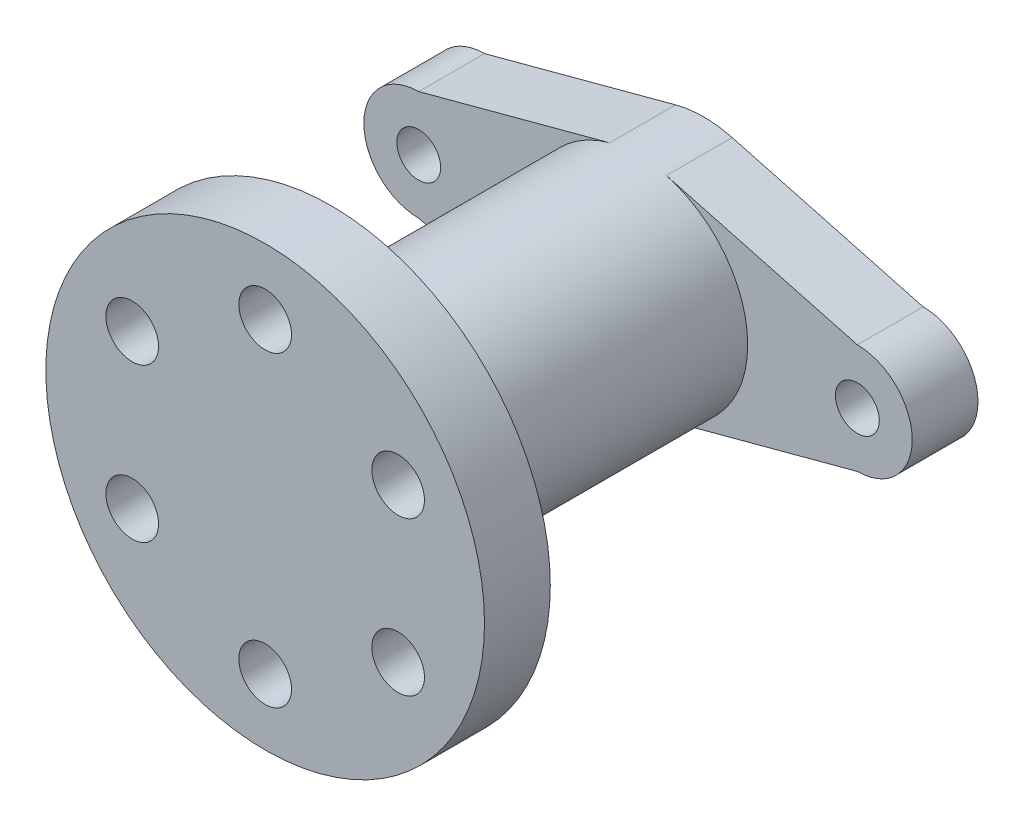
ISO-10303-21;
HEADER;
FILE_DESCRIPTION(('STEP AP214'),'2;1');
FILE_NAME('part.step','',(''),(''),'','','');
FILE_SCHEMA(('AUTOMOTIVE_DESIGN { 1 0 10303 214 1 1 1 1 }'));
ENDSEC;
DATA;
#1=APPLICATION_CONTEXT('core data for automotive mechanical design processes');
#2=APPLICATION_PROTOCOL_DEFINITION('international standard','automotive_design',2000,#1);
#3=PRODUCT_CONTEXT('',#1,'mechanical');
#4=PRODUCT('Part','Part','',(#3));
#5=PRODUCT_RELATED_PRODUCT_CATEGORY('part','',(#4));
#6=PRODUCT_DEFINITION_FORMATION('','',#4);
#7=PRODUCT_DEFINITION_CONTEXT('part definition',#1,'design');
#8=PRODUCT_DEFINITION('design','',#6,#7);
#9=PRODUCT_DEFINITION_SHAPE('','',#8);
#10=(LENGTH_UNIT() NAMED_UNIT(*) SI_UNIT(.MILLI.,.METRE.));
#11=(NAMED_UNIT(*) PLANE_ANGLE_UNIT() SI_UNIT($,.RADIAN.));
#12=(NAMED_UNIT(*) SI_UNIT($,.STERADIAN.) SOLID_ANGLE_UNIT());
#13=UNCERTAINTY_MEASURE_WITH_UNIT(LENGTH_MEASURE(1.E-05),#10,'distance_accuracy_value','');
#14=(GEOMETRIC_REPRESENTATION_CONTEXT(3) GLOBAL_UNCERTAINTY_ASSIGNED_CONTEXT((#13)) GLOBAL_UNIT_ASSIGNED_CONTEXT((#10,
#11,#12)) REPRESENTATION_CONTEXT('',''));
#15=CARTESIAN_POINT('',(0.,0.,0.));
#16=DIRECTION('',(0.,0.,1.));
#17=DIRECTION('',(1.,0.,0.));
#18=AXIS2_PLACEMENT_3D('',#15,#16,#17);
#19=CARTESIAN_POINT('',(0.,0.,15.));
#20=DIRECTION('',(0.,0.,-1.));
#21=DIRECTION('',(-1.,0.,0.));
#22=AXIS2_PLACEMENT_3D('',#19,#20,#21);
#23=CYLINDRICAL_SURFACE('',#22,50.);
#24=CARTESIAN_POINT('',(0.,0.,15.));
#25=DIRECTION('',(0.,0.,1.));
#26=DIRECTION('',(1.,0.,0.));
#27=AXIS2_PLACEMENT_3D('',#24,#25,#26);
#28=CIRCLE('',#27,50.);
#29=CARTESIAN_POINT('',(50.,0.,15.));
#30=VERTEX_POINT('',#29);
#31=EDGE_CURVE('E43',#30,#30,#28,.T.);
#32=ORIENTED_EDGE('',*,*,#31,.F.);
#33=EDGE_LOOP('',(#32));
#34=FACE_BOUND('',#33,.T.);
#35=CARTESIAN_POINT('',(0.,0.,0.));
#36=DIRECTION('',(0.,0.,1.));
#37=DIRECTION('',(1.,0.,0.));
#38=AXIS2_PLACEMENT_3D('',#35,#36,#37);
#39=CIRCLE('',#38,50.);
#40=CARTESIAN_POINT('',(50.,0.,0.));
#41=VERTEX_POINT('',#40);
#42=EDGE_CURVE('E134',#41,#41,#39,.T.);
#43=ORIENTED_EDGE('',*,*,#42,.T.);
#44=EDGE_LOOP('',(#43));
#45=FACE_BOUND('',#44,.T.);
#46=ADVANCED_FACE('F35',(#34,#45),#23,.T.);
#47=CARTESIAN_POINT('',(0.,0.,15.));
#48=DIRECTION('',(0.,0.,1.));
#49=DIRECTION('',(1.,0.,0.));
#50=AXIS2_PLACEMENT_3D('',#47,#48,#49);
#51=PLANE('',#50);
#52=CARTESIAN_POINT('',(-30.3108891324561,17.5000000000013,15.));
#53=DIRECTION('',(0.,0.,1.));
#54=DIRECTION('',(1.,0.,0.));
#55=AXIS2_PLACEMENT_3D('',#52,#53,#54);
#56=CIRCLE('',#55,6.00000000000041);
#57=CARTESIAN_POINT('',(-24.3108891324557,17.5000000000013,15.));
#58=VERTEX_POINT('',#57);
#59=EDGE_CURVE('E352',#58,#58,#56,.T.);
#60=ORIENTED_EDGE('',*,*,#59,.F.);
#61=EDGE_LOOP('',(#60));
#62=FACE_BOUND('',#61,.T.);
#63=CARTESIAN_POINT('',(-30.3108891324576,-17.4999999999987,15.));
#64=DIRECTION('',(0.,0.,1.));
#65=DIRECTION('',(1.,0.,0.));
#66=AXIS2_PLACEMENT_3D('',#63,#64,#65);
#67=CIRCLE('',#66,6.00000000000193);
#68=CARTESIAN_POINT('',(-24.3108891324557,-17.4999999999987,15.));
#69=VERTEX_POINT('',#68);
#70=EDGE_CURVE('E354',#69,#69,#67,.T.);
#71=ORIENTED_EDGE('',*,*,#70,.F.);
#72=EDGE_LOOP('',(#71));
#73=FACE_BOUND('',#72,.T.);
#74=CARTESIAN_POINT('',(-2.97570696259839E-12,-35.,15.));
#75=DIRECTION('',(0.,0.,1.));
#76=DIRECTION('',(1.,0.,0.));
#77=AXIS2_PLACEMENT_3D('',#74,#75,#76);
#78=CIRCLE('',#77,6.00000000000308);
#79=CARTESIAN_POINT('',(6.0000000000001,-35.,15.));
#80=VERTEX_POINT('',#79);
#81=EDGE_CURVE('E357',#80,#80,#78,.T.);
#82=ORIENTED_EDGE('',*,*,#81,.F.);
#83=EDGE_LOOP('',(#82));
#84=FACE_BOUND('',#83,.T.);
#85=CARTESIAN_POINT('',(30.3108891324531,-17.5000000000013,15.));
#86=DIRECTION('',(0.,0.,1.));
#87=DIRECTION('',(1.,0.,0.));
#88=AXIS2_PLACEMENT_3D('',#85,#86,#87);
#89=CIRCLE('',#88,6.00000000000283);
#90=CARTESIAN_POINT('',(36.3108891324559,-17.5000000000013,15.));
#91=VERTEX_POINT('',#90);
#92=EDGE_CURVE('E360',#91,#91,#89,.T.);
#93=ORIENTED_EDGE('',*,*,#92,.F.);
#94=EDGE_LOOP('',(#93));
#95=FACE_BOUND('',#94,.T.);
#96=CARTESIAN_POINT('',(30.3108891324546,17.4999999999987,15.));
#97=DIRECTION('',(0.,0.,1.));
#98=DIRECTION('',(1.,0.,0.));
#99=AXIS2_PLACEMENT_3D('',#96,#97,#98);
#100=CIRCLE('',#99,6.0000000000015);
#101=CARTESIAN_POINT('',(36.3108891324561,17.4999999999987,15.));
#102=VERTEX_POINT('',#101);
#103=EDGE_CURVE('E363',#102,#102,#100,.T.);
#104=ORIENTED_EDGE('',*,*,#103,.F.);
#105=EDGE_LOOP('',(#104));
#106=FACE_BOUND('',#105,.T.);
#107=CARTESIAN_POINT('',(0.,35.,15.));
#108=DIRECTION('',(0.,0.,1.));
#109=DIRECTION('',(1.,0.,0.));
#110=AXIS2_PLACEMENT_3D('',#107,#108,#109);
#111=CIRCLE('',#110,6.);
#112=CARTESIAN_POINT('',(6.,35.,15.));
#113=VERTEX_POINT('',#112);
#114=EDGE_CURVE('E346',#113,#113,#111,.T.);
#115=ORIENTED_EDGE('',*,*,#114,.F.);
#116=EDGE_LOOP('',(#115));
#117=FACE_BOUND('',#116,.T.);
#118=ORIENTED_EDGE('',*,*,#31,.T.);
#119=EDGE_LOOP('',(#118));
#120=FACE_BOUND('',#119,.T.);
#121=ADVANCED_FACE('F142',(#62,#73,#84,#95,#106,#117,#120),#51,.T.);
#122=CARTESIAN_POINT('',(0.,0.,0.));
#123=DIRECTION('',(0.,0.,1.));
#124=DIRECTION('',(1.,0.,0.));
#125=AXIS2_PLACEMENT_3D('',#122,#123,#124);
#126=PLANE('',#125);
#127=CARTESIAN_POINT('',(-30.3108891324561,17.5000000000013,0.));
#128=DIRECTION('',(0.,0.,-1.));
#129=DIRECTION('',(-1.,0.,0.));
#130=AXIS2_PLACEMENT_3D('',#127,#128,#129);
#131=CIRCLE('',#130,6.00000000000041);
#132=CARTESIAN_POINT('',(-36.3108891324565,17.5000000000013,0.));
#133=VERTEX_POINT('',#132);
#134=EDGE_CURVE('E366',#133,#133,#131,.T.);
#135=ORIENTED_EDGE('',*,*,#134,.F.);
#136=EDGE_LOOP('',(#135));
#137=FACE_BOUND('',#136,.T.);
#138=CARTESIAN_POINT('',(-30.3108891324576,-17.4999999999987,0.));
#139=DIRECTION('',(0.,0.,-1.));
#140=DIRECTION('',(-1.,0.,0.));
#141=AXIS2_PLACEMENT_3D('',#138,#139,#140);
#142=CIRCLE('',#141,6.00000000000193);
#143=CARTESIAN_POINT('',(-36.3108891324595,-17.4999999999987,0.));
#144=VERTEX_POINT('',#143);
#145=EDGE_CURVE('E376',#144,#144,#142,.T.);
#146=ORIENTED_EDGE('',*,*,#145,.F.);
#147=EDGE_LOOP('',(#146));
#148=FACE_BOUND('',#147,.T.);
#149=CARTESIAN_POINT('',(-2.97570696259839E-12,-35.,0.));
#150=DIRECTION('',(0.,0.,-1.));
#151=DIRECTION('',(-1.,0.,0.));
#152=AXIS2_PLACEMENT_3D('',#149,#150,#151);
#153=CIRCLE('',#152,6.00000000000308);
#154=CARTESIAN_POINT('',(-6.00000000000606,-35.,0.));
#155=VERTEX_POINT('',#154);
#156=EDGE_CURVE('E373',#155,#155,#153,.T.);
#157=ORIENTED_EDGE('',*,*,#156,.F.);
#158=EDGE_LOOP('',(#157));
#159=FACE_BOUND('',#158,.T.);
#160=CARTESIAN_POINT('',(30.3108891324531,-17.5000000000013,0.));
#161=DIRECTION('',(0.,0.,-1.));
#162=DIRECTION('',(-1.,0.,0.));
#163=AXIS2_PLACEMENT_3D('',#160,#161,#162);
#164=CIRCLE('',#163,6.00000000000283);
#165=CARTESIAN_POINT('',(24.3108891324503,-17.5000000000013,0.));
#166=VERTEX_POINT('',#165);
#167=EDGE_CURVE('E370',#166,#166,#164,.T.);
#168=ORIENTED_EDGE('',*,*,#167,.F.);
#169=EDGE_LOOP('',(#168));
#170=FACE_BOUND('',#169,.T.);
#171=CARTESIAN_POINT('',(30.3108891324546,17.4999999999987,0.));
#172=DIRECTION('',(0.,0.,-1.));
#173=DIRECTION('',(-1.,0.,0.));
#174=AXIS2_PLACEMENT_3D('',#171,#172,#173);
#175=CIRCLE('',#174,6.0000000000015);
#176=CARTESIAN_POINT('',(24.3108891324531,17.4999999999987,0.));
#177=VERTEX_POINT('',#176);
#178=EDGE_CURVE('E367',#177,#177,#175,.T.);
#179=ORIENTED_EDGE('',*,*,#178,.F.);
#180=EDGE_LOOP('',(#179));
#181=FACE_BOUND('',#180,.T.);
#182=CARTESIAN_POINT('',(0.,35.,0.));
#183=DIRECTION('',(0.,0.,-1.));
#184=DIRECTION('',(-1.,0.,0.));
#185=AXIS2_PLACEMENT_3D('',#182,#183,#184);
#186=CIRCLE('',#185,6.);
#187=CARTESIAN_POINT('',(-6.,35.,0.));
#188=VERTEX_POINT('',#187);
#189=EDGE_CURVE('E349',#188,#188,#186,.T.);
#190=ORIENTED_EDGE('',*,*,#189,.F.);
#191=EDGE_LOOP('',(#190));
#192=FACE_BOUND('',#191,.T.);
#193=CARTESIAN_POINT('',(0.,0.,0.));
#194=DIRECTION('',(0.,0.,1.));
#195=DIRECTION('',(1.,0.,0.));
#196=AXIS2_PLACEMENT_3D('',#193,#194,#195);
#197=CIRCLE('',#196,25.);
#198=CARTESIAN_POINT('',(25.,0.,0.));
#199=VERTEX_POINT('',#198);
#200=EDGE_CURVE('E11',#199,#199,#197,.F.);
#201=ORIENTED_EDGE('',*,*,#200,.F.);
#202=EDGE_LOOP('',(#201));
#203=FACE_BOUND('',#202,.T.);
#204=ORIENTED_EDGE('',*,*,#42,.F.);
#205=EDGE_LOOP('',(#204));
#206=FACE_BOUND('',#205,.T.);
#207=ADVANCED_FACE('F139',(#137,#148,#159,#170,#181,#192,#203,#206),#126,.F.);
#208=CARTESIAN_POINT('',(0.,0.,-70.));
#209=DIRECTION('',(0.,0.,1.));
#210=DIRECTION('',(1.,0.,0.));
#211=AXIS2_PLACEMENT_3D('',#208,#209,#210);
#212=CYLINDRICAL_SURFACE('',#211,25.);
#213=CARTESIAN_POINT('',(0.,0.,-70.));
#214=DIRECTION('',(0.,0.,-1.));
#215=DIRECTION('',(-1.,0.,0.));
#216=AXIS2_PLACEMENT_3D('',#213,#214,#215);
#217=CIRCLE('',#216,25.);
#218=CARTESIAN_POINT('',(6.46242459490589,24.1503016203764,-70.));
#219=VERTEX_POINT('',#218);
#220=CARTESIAN_POINT('',(6.4624245949059,-24.1503016203764,-70.));
#221=VERTEX_POINT('',#220);
#222=EDGE_CURVE('E58',#219,#221,#217,.T.);
#223=ORIENTED_EDGE('',*,*,#222,.F.);
#224=DIRECTION('',(0.,0.,1.));
#225=VECTOR('',#224,1.);
#226=CARTESIAN_POINT('',(6.46242459490591,24.1503016203764,-85.));
#227=LINE('',#226,#225);
#228=CARTESIAN_POINT('',(6.46242459490591,24.1503016203764,-85.));
#229=VERTEX_POINT('',#228);
#230=EDGE_CURVE('E302',#229,#219,#227,.T.);
#231=ORIENTED_EDGE('',*,*,#230,.F.);
#232=CARTESIAN_POINT('',(0.,0.,-85.));
#233=DIRECTION('',(0.,0.,-1.));
#234=DIRECTION('',(-1.,0.,0.));
#235=AXIS2_PLACEMENT_3D('',#232,#233,#234);
#236=CIRCLE('',#235,25.);
#237=CARTESIAN_POINT('',(-6.46242459490592,24.1503016203764,-85.));
#238=VERTEX_POINT('',#237);
#239=EDGE_CURVE('E326',#238,#229,#236,.T.);
#240=ORIENTED_EDGE('',*,*,#239,.F.);
#241=DIRECTION('',(0.,0.,1.));
#242=VECTOR('',#241,1.);
#243=CARTESIAN_POINT('',(-6.46242459490592,24.1503016203764,-85.));
#244=LINE('',#243,#242);
#245=CARTESIAN_POINT('',(-6.46242459490592,24.1503016203764,-70.));
#246=VERTEX_POINT('',#245);
#247=EDGE_CURVE('E304',#238,#246,#244,.T.);
#248=ORIENTED_EDGE('',*,*,#247,.T.);
#249=CARTESIAN_POINT('',(-6.46242459490591,-24.1503016203764,-70.));
#250=VERTEX_POINT('',#249);
#251=EDGE_CURVE('E50',#250,#246,#217,.T.);
#252=ORIENTED_EDGE('',*,*,#251,.F.);
#253=DIRECTION('',(0.,0.,1.));
#254=VECTOR('',#253,1.);
#255=CARTESIAN_POINT('',(-6.4624245949059,-24.1503016203764,-85.));
#256=LINE('',#255,#254);
#257=CARTESIAN_POINT('',(-6.4624245949059,-24.1503016203764,-85.));
#258=VERTEX_POINT('',#257);
#259=EDGE_CURVE('E128',#258,#250,#256,.T.);
#260=ORIENTED_EDGE('',*,*,#259,.F.);
#261=CARTESIAN_POINT('',(0.,0.,-85.));
#262=DIRECTION('',(0.,0.,-1.));
#263=DIRECTION('',(-1.,0.,0.));
#264=AXIS2_PLACEMENT_3D('',#261,#262,#263);
#265=CIRCLE('',#264,25.);
#266=CARTESIAN_POINT('',(6.4624245949059,-24.1503016203764,-85.));
#267=VERTEX_POINT('',#266);
#268=EDGE_CURVE('E111',#267,#258,#265,.T.);
#269=ORIENTED_EDGE('',*,*,#268,.F.);
#270=DIRECTION('',(0.,0.,1.));
#271=VECTOR('',#270,1.);
#272=CARTESIAN_POINT('',(6.4624245949059,-24.1503016203764,-85.));
#273=LINE('',#272,#271);
#274=EDGE_CURVE('E108',#267,#221,#273,.T.);
#275=ORIENTED_EDGE('',*,*,#274,.T.);
#276=EDGE_LOOP('',(#223,#231,#240,#248,#252,#260,#269,#275));
#277=FACE_BOUND('',#276,.T.);
#278=ORIENTED_EDGE('',*,*,#200,.T.);
#279=EDGE_LOOP('',(#278));
#280=FACE_BOUND('',#279,.T.);
#281=ADVANCED_FACE('F141',(#277,#280),#212,.T.);
#282=CARTESIAN_POINT('',(50.,0.,-70.));
#283=DIRECTION('',(0.,0.,1.));
#284=DIRECTION('',(1.,0.,0.));
#285=AXIS2_PLACEMENT_3D('',#282,#283,#284);
#286=PLANE('',#285);
#287=CARTESIAN_POINT('',(50.,0.,-70.));
#288=DIRECTION('',(0.,0.,1.));
#289=DIRECTION('',(1.,0.,0.));
#290=AXIS2_PLACEMENT_3D('',#287,#288,#289);
#291=CIRCLE('',#290,5.);
#292=CARTESIAN_POINT('',(55.,0.,-70.));
#293=VERTEX_POINT('',#292);
#294=EDGE_CURVE('E291',#293,#293,#291,.T.);
#295=ORIENTED_EDGE('',*,*,#294,.F.);
#296=EDGE_LOOP('',(#295));
#297=FACE_BOUND('',#296,.T.);
#298=DIRECTION('',(0.966012064815056,-0.258496983796236,0.));
#299=VECTOR('',#298,1.);
#300=CARTESIAN_POINT('',(50.,12.5,-70.));
#301=LINE('',#300,#299);
#302=CARTESIAN_POINT('',(50.,12.5,-70.));
#303=VERTEX_POINT('',#302);
#304=EDGE_CURVE('E121',#219,#303,#301,.T.);
#305=ORIENTED_EDGE('',*,*,#304,.F.);
#306=ORIENTED_EDGE('',*,*,#222,.T.);
#307=DIRECTION('',(-0.966012064815056,-0.258496983796236,0.));
#308=VECTOR('',#307,1.);
#309=CARTESIAN_POINT('',(50.,-12.5,-70.));
#310=LINE('',#309,#308);
#311=CARTESIAN_POINT('',(50.,-12.5,-70.));
#312=VERTEX_POINT('',#311);
#313=EDGE_CURVE('E319',#312,#221,#310,.T.);
#314=ORIENTED_EDGE('',*,*,#313,.F.);
#315=CARTESIAN_POINT('',(50.,0.,-70.));
#316=DIRECTION('',(0.,0.,-1.));
#317=DIRECTION('',(1.,0.,0.));
#318=AXIS2_PLACEMENT_3D('',#315,#316,#317);
#319=CIRCLE('',#318,12.5);
#320=EDGE_CURVE('E125',#303,#312,#319,.T.);
#321=ORIENTED_EDGE('',*,*,#320,.F.);
#322=EDGE_LOOP('',(#305,#306,#314,#321));
#323=FACE_BOUND('',#322,.T.);
#324=ADVANCED_FACE('F148',(#297,#323),#286,.T.);
#325=CARTESIAN_POINT('',(50.,0.,-85.));
#326=DIRECTION('',(0.,0.,1.));
#327=DIRECTION('',(1.,0.,0.));
#328=AXIS2_PLACEMENT_3D('',#325,#326,#327);
#329=CYLINDRICAL_SURFACE('',#328,12.5);
#330=ORIENTED_EDGE('',*,*,#320,.T.);
#331=DIRECTION('',(0.,0.,1.));
#332=VECTOR('',#331,1.);
#333=CARTESIAN_POINT('',(50.,-12.5,-85.));
#334=LINE('',#333,#332);
#335=CARTESIAN_POINT('',(50.,-12.5,-85.));
#336=VERTEX_POINT('',#335);
#337=EDGE_CURVE('E105',#336,#312,#334,.T.);
#338=ORIENTED_EDGE('',*,*,#337,.F.);
#339=CARTESIAN_POINT('',(50.,0.,-85.));
#340=DIRECTION('',(0.,0.,-1.));
#341=DIRECTION('',(1.,0.,0.));
#342=AXIS2_PLACEMENT_3D('',#339,#340,#341);
#343=CIRCLE('',#342,12.5);
#344=CARTESIAN_POINT('',(50.,12.5,-85.));
#345=VERTEX_POINT('',#344);
#346=EDGE_CURVE('E112',#345,#336,#343,.T.);
#347=ORIENTED_EDGE('',*,*,#346,.F.);
#348=DIRECTION('',(0.,0.,1.));
#349=VECTOR('',#348,1.);
#350=CARTESIAN_POINT('',(50.,12.5,-85.));
#351=LINE('',#350,#349);
#352=EDGE_CURVE('E300',#345,#303,#351,.T.);
#353=ORIENTED_EDGE('',*,*,#352,.T.);
#354=EDGE_LOOP('',(#330,#338,#347,#353));
#355=FACE_BOUND('',#354,.T.);
#356=ADVANCED_FACE('F123',(#355),#329,.T.);
#357=CARTESIAN_POINT('',(50.,-12.5,-85.));
#358=DIRECTION('',(-0.258496983796236,0.966012064815056,0.));
#359=DIRECTION('',(-0.966012064815056,-0.258496983796236,0.));
#360=AXIS2_PLACEMENT_3D('',#357,#358,#359);
#361=PLANE('',#360);
#362=ORIENTED_EDGE('',*,*,#313,.T.);
#363=ORIENTED_EDGE('',*,*,#274,.F.);
#364=DIRECTION('',(-0.966012064815056,-0.258496983796236,0.));
#365=VECTOR('',#364,1.);
#366=CARTESIAN_POINT('',(50.,-12.5,-85.));
#367=LINE('',#366,#365);
#368=EDGE_CURVE('E101',#336,#267,#367,.T.);
#369=ORIENTED_EDGE('',*,*,#368,.F.);
#370=ORIENTED_EDGE('',*,*,#337,.T.);
#371=EDGE_LOOP('',(#362,#363,#369,#370));
#372=FACE_BOUND('',#371,.T.);
#373=ADVANCED_FACE('F103',(#372),#361,.F.);
#374=CARTESIAN_POINT('',(-50.,-12.5,-85.));
#375=DIRECTION('',(0.258496983796236,0.966012064815056,0.));
#376=DIRECTION('',(-0.966012064815056,0.258496983796236,0.));
#377=AXIS2_PLACEMENT_3D('',#374,#375,#376);
#378=PLANE('',#377);
#379=DIRECTION('',(-0.966012064815056,0.258496983796236,0.));
#380=VECTOR('',#379,1.);
#381=CARTESIAN_POINT('',(-50.,-12.5,-70.));
#382=LINE('',#381,#380);
#383=CARTESIAN_POINT('',(-50.,-12.5,-70.));
#384=VERTEX_POINT('',#383);
#385=EDGE_CURVE('E314',#250,#384,#382,.T.);
#386=ORIENTED_EDGE('',*,*,#385,.T.);
#387=DIRECTION('',(0.,0.,1.));
#388=VECTOR('',#387,1.);
#389=CARTESIAN_POINT('',(-50.,-12.5,-85.));
#390=LINE('',#389,#388);
#391=CARTESIAN_POINT('',(-50.,-12.5,-85.));
#392=VERTEX_POINT('',#391);
#393=EDGE_CURVE('E309',#392,#384,#390,.T.);
#394=ORIENTED_EDGE('',*,*,#393,.F.);
#395=DIRECTION('',(-0.966012064815056,0.258496983796236,0.));
#396=VECTOR('',#395,1.);
#397=CARTESIAN_POINT('',(-50.,-12.5,-85.));
#398=LINE('',#397,#396);
#399=EDGE_CURVE('E315',#258,#392,#398,.T.);
#400=ORIENTED_EDGE('',*,*,#399,.F.);
#401=ORIENTED_EDGE('',*,*,#259,.T.);
#402=EDGE_LOOP('',(#386,#394,#400,#401));
#403=FACE_BOUND('',#402,.T.);
#404=ADVANCED_FACE('F275',(#403),#378,.F.);
#405=CARTESIAN_POINT('',(-50.,0.,-85.));
#406=DIRECTION('',(0.,0.,1.));
#407=DIRECTION('',(1.,0.,0.));
#408=AXIS2_PLACEMENT_3D('',#405,#406,#407);
#409=CYLINDRICAL_SURFACE('',#408,12.5);
#410=CARTESIAN_POINT('',(-50.,0.,-70.));
#411=DIRECTION('',(0.,0.,-1.));
#412=DIRECTION('',(-1.,0.,0.));
#413=AXIS2_PLACEMENT_3D('',#410,#411,#412);
#414=CIRCLE('',#413,12.5);
#415=CARTESIAN_POINT('',(-50.,12.5,-70.));
#416=VERTEX_POINT('',#415);
#417=EDGE_CURVE('E296',#384,#416,#414,.T.);
#418=ORIENTED_EDGE('',*,*,#417,.T.);
#419=DIRECTION('',(0.,0.,1.));
#420=VECTOR('',#419,1.);
#421=CARTESIAN_POINT('',(-50.,12.5,-85.));
#422=LINE('',#421,#420);
#423=CARTESIAN_POINT('',(-50.,12.5,-85.));
#424=VERTEX_POINT('',#423);
#425=EDGE_CURVE('E306',#424,#416,#422,.T.);
#426=ORIENTED_EDGE('',*,*,#425,.F.);
#427=CARTESIAN_POINT('',(-50.,0.,-85.));
#428=DIRECTION('',(0.,0.,-1.));
#429=DIRECTION('',(-1.,0.,0.));
#430=AXIS2_PLACEMENT_3D('',#427,#428,#429);
#431=CIRCLE('',#430,12.5);
#432=EDGE_CURVE('E330',#392,#424,#431,.T.);
#433=ORIENTED_EDGE('',*,*,#432,.F.);
#434=ORIENTED_EDGE('',*,*,#393,.T.);
#435=EDGE_LOOP('',(#418,#426,#433,#434));
#436=FACE_BOUND('',#435,.T.);
#437=ADVANCED_FACE('F271',(#436),#409,.T.);
#438=CARTESIAN_POINT('',(-50.,12.5,-85.));
#439=DIRECTION('',(0.258496983796236,-0.966012064815056,0.));
#440=DIRECTION('',(0.966012064815057,0.258496983796236,0.));
#441=AXIS2_PLACEMENT_3D('',#438,#439,#440);
#442=PLANE('',#441);
#443=DIRECTION('',(0.966012064815057,0.258496983796236,0.));
#444=VECTOR('',#443,1.);
#445=CARTESIAN_POINT('',(-50.,12.5,-70.));
#446=LINE('',#445,#444);
#447=EDGE_CURVE('E293',#416,#246,#446,.T.);
#448=ORIENTED_EDGE('',*,*,#447,.T.);
#449=ORIENTED_EDGE('',*,*,#247,.F.);
#450=DIRECTION('',(0.966012064815057,0.258496983796236,0.));
#451=VECTOR('',#450,1.);
#452=CARTESIAN_POINT('',(-50.,12.5,-85.));
#453=LINE('',#452,#451);
#454=EDGE_CURVE('E328',#424,#238,#453,.T.);
#455=ORIENTED_EDGE('',*,*,#454,.F.);
#456=ORIENTED_EDGE('',*,*,#425,.T.);
#457=EDGE_LOOP('',(#448,#449,#455,#456));
#458=FACE_BOUND('',#457,.T.);
#459=ADVANCED_FACE('F267',(#458),#442,.F.);
#460=CARTESIAN_POINT('',(50.,12.5,-85.));
#461=DIRECTION('',(-0.258496983796236,-0.966012064815056,0.));
#462=DIRECTION('',(0.966012064815056,-0.258496983796236,0.));
#463=AXIS2_PLACEMENT_3D('',#460,#461,#462);
#464=PLANE('',#463);
#465=ORIENTED_EDGE('',*,*,#304,.T.);
#466=ORIENTED_EDGE('',*,*,#352,.F.);
#467=DIRECTION('',(0.966012064815056,-0.258496983796236,0.));
#468=VECTOR('',#467,1.);
#469=CARTESIAN_POINT('',(50.,12.5,-85.));
#470=LINE('',#469,#468);
#471=EDGE_CURVE('E117',#229,#345,#470,.T.);
#472=ORIENTED_EDGE('',*,*,#471,.F.);
#473=ORIENTED_EDGE('',*,*,#230,.T.);
#474=EDGE_LOOP('',(#465,#466,#472,#473));
#475=FACE_BOUND('',#474,.T.);
#476=ADVANCED_FACE('F260',(#475),#464,.F.);
#477=CARTESIAN_POINT('',(50.,0.,-85.));
#478=DIRECTION('',(0.,0.,1.));
#479=DIRECTION('',(1.,0.,0.));
#480=AXIS2_PLACEMENT_3D('',#477,#478,#479);
#481=PLANE('',#480);
#482=CARTESIAN_POINT('',(50.,0.,-85.));
#483=DIRECTION('',(0.,0.,-1.));
#484=DIRECTION('',(1.,0.,0.));
#485=AXIS2_PLACEMENT_3D('',#482,#483,#484);
#486=CIRCLE('',#485,5.);
#487=CARTESIAN_POINT('',(55.,0.,-85.));
#488=VERTEX_POINT('',#487);
#489=EDGE_CURVE('E343',#488,#488,#486,.T.);
#490=ORIENTED_EDGE('',*,*,#489,.F.);
#491=EDGE_LOOP('',(#490));
#492=FACE_BOUND('',#491,.T.);
#493=CARTESIAN_POINT('',(-50.,0.,-85.));
#494=DIRECTION('',(0.,0.,-1.));
#495=DIRECTION('',(-1.,0.,0.));
#496=AXIS2_PLACEMENT_3D('',#493,#494,#495);
#497=CIRCLE('',#496,5.);
#498=CARTESIAN_POINT('',(-55.,0.,-85.));
#499=VERTEX_POINT('',#498);
#500=EDGE_CURVE('E339',#499,#499,#497,.T.);
#501=ORIENTED_EDGE('',*,*,#500,.F.);
#502=EDGE_LOOP('',(#501));
#503=FACE_BOUND('',#502,.T.);
#504=CARTESIAN_POINT('',(0.,0.,-85.));
#505=DIRECTION('',(0.,0.,-1.));
#506=DIRECTION('',(-1.,0.,0.));
#507=AXIS2_PLACEMENT_3D('',#504,#505,#506);
#508=CIRCLE('',#507,15.);
#509=CARTESIAN_POINT('',(-15.,0.,-85.));
#510=VERTEX_POINT('',#509);
#511=EDGE_CURVE('E334',#510,#510,#508,.T.);
#512=ORIENTED_EDGE('',*,*,#511,.F.);
#513=EDGE_LOOP('',(#512));
#514=FACE_BOUND('',#513,.T.);
#515=ORIENTED_EDGE('',*,*,#346,.T.);
#516=ORIENTED_EDGE('',*,*,#368,.T.);
#517=ORIENTED_EDGE('',*,*,#268,.T.);
#518=ORIENTED_EDGE('',*,*,#399,.T.);
#519=ORIENTED_EDGE('',*,*,#432,.T.);
#520=ORIENTED_EDGE('',*,*,#454,.T.);
#521=ORIENTED_EDGE('',*,*,#239,.T.);
#522=ORIENTED_EDGE('',*,*,#471,.T.);
#523=EDGE_LOOP('',(#515,#516,#517,#518,#519,#520,#521,#522));
#524=FACE_BOUND('',#523,.T.);
#525=ADVANCED_FACE('F115',(#492,#503,#514,#524),#481,.F.);
#526=CARTESIAN_POINT('',(-50.,0.,-70.));
#527=DIRECTION('',(0.,0.,1.));
#528=DIRECTION('',(1.,0.,0.));
#529=AXIS2_PLACEMENT_3D('',#526,#527,#528);
#530=CIRCLE('',#529,5.);
#531=CARTESIAN_POINT('',(-45.,0.,-70.));
#532=VERTEX_POINT('',#531);
#533=EDGE_CURVE('E38',#532,#532,#530,.T.);
#534=ORIENTED_EDGE('',*,*,#533,.F.);
#535=EDGE_LOOP('',(#534));
#536=FACE_BOUND('',#535,.T.);
#537=ORIENTED_EDGE('',*,*,#385,.F.);
#538=ORIENTED_EDGE('',*,*,#251,.T.);
#539=ORIENTED_EDGE('',*,*,#447,.F.);
#540=ORIENTED_EDGE('',*,*,#417,.F.);
#541=EDGE_LOOP('',(#537,#538,#539,#540));
#542=FACE_BOUND('',#541,.T.);
#543=ADVANCED_FACE('F256',(#536,#542),#286,.T.);
#544=CARTESIAN_POINT('',(0.,0.,0.));
#545=DIRECTION('',(0.,0.,-1.));
#546=DIRECTION('',(-1.,0.,0.));
#547=AXIS2_PLACEMENT_3D('',#544,#545,#546);
#548=CYLINDRICAL_SURFACE('',#547,15.);
#549=CARTESIAN_POINT('',(0.,0.,0.));
#550=DIRECTION('',(0.,0.,-1.));
#551=DIRECTION('',(-1.,0.,0.));
#552=AXIS2_PLACEMENT_3D('',#549,#550,#551);
#553=CIRCLE('',#552,15.);
#554=CARTESIAN_POINT('',(-15.,0.,0.));
#555=VERTEX_POINT('',#554);
#556=EDGE_CURVE('E324',#555,#555,#553,.T.);
#557=ORIENTED_EDGE('',*,*,#556,.F.);
#558=EDGE_LOOP('',(#557));
#559=FACE_BOUND('',#558,.T.);
#560=ORIENTED_EDGE('',*,*,#511,.T.);
#561=EDGE_LOOP('',(#560));
#562=FACE_BOUND('',#561,.T.);
#563=ADVANCED_FACE('F252',(#559,#562),#548,.F.);
#564=CARTESIAN_POINT('',(0.,0.,0.));
#565=DIRECTION('',(0.,0.,-1.));
#566=DIRECTION('',(-1.,0.,0.));
#567=AXIS2_PLACEMENT_3D('',#564,#565,#566);
#568=PLANE('',#567);
#569=ORIENTED_EDGE('',*,*,#556,.T.);
#570=EDGE_LOOP('',(#569));
#571=FACE_BOUND('',#570,.T.);
#572=ADVANCED_FACE('F248',(#571),#568,.T.);
#573=CARTESIAN_POINT('',(-50.,0.,-55.));
#574=DIRECTION('',(0.,0.,-1.));
#575=DIRECTION('',(-1.,0.,0.));
#576=AXIS2_PLACEMENT_3D('',#573,#574,#575);
#577=CYLINDRICAL_SURFACE('',#576,5.);
#578=ORIENTED_EDGE('',*,*,#533,.T.);
#579=EDGE_LOOP('',(#578));
#580=FACE_BOUND('',#579,.T.);
#581=ORIENTED_EDGE('',*,*,#500,.T.);
#582=EDGE_LOOP('',(#581));
#583=FACE_BOUND('',#582,.T.);
#584=ADVANCED_FACE('F244',(#580,#583),#577,.F.);
#585=CARTESIAN_POINT('',(50.,0.,-55.));
#586=DIRECTION('',(0.,0.,-1.));
#587=DIRECTION('',(-1.,0.,0.));
#588=AXIS2_PLACEMENT_3D('',#585,#586,#587);
#589=CYLINDRICAL_SURFACE('',#588,5.);
#590=ORIENTED_EDGE('',*,*,#294,.T.);
#591=EDGE_LOOP('',(#590));
#592=FACE_BOUND('',#591,.T.);
#593=ORIENTED_EDGE('',*,*,#489,.T.);
#594=EDGE_LOOP('',(#593));
#595=FACE_BOUND('',#594,.T.);
#596=ADVANCED_FACE('F171',(#592,#595),#589,.F.);
#597=CARTESIAN_POINT('',(0.,35.,30.));
#598=DIRECTION('',(0.,0.,-1.));
#599=DIRECTION('',(-1.,0.,0.));
#600=AXIS2_PLACEMENT_3D('',#597,#598,#599);
#601=CYLINDRICAL_SURFACE('',#600,6.);
#602=ORIENTED_EDGE('',*,*,#114,.T.);
#603=EDGE_LOOP('',(#602));
#604=FACE_BOUND('',#603,.T.);
#605=ORIENTED_EDGE('',*,*,#189,.T.);
#606=EDGE_LOOP('',(#605));
#607=FACE_BOUND('',#606,.T.);
#608=ADVANCED_FACE('F181',(#604,#607),#601,.F.);
#609=CARTESIAN_POINT('',(30.3108891324546,17.4999999999987,30.));
#610=DIRECTION('',(0.,0.,-1.));
#611=DIRECTION('',(-1.,0.,0.));
#612=AXIS2_PLACEMENT_3D('',#609,#610,#611);
#613=CYLINDRICAL_SURFACE('',#612,6.0000000000015);
#614=ORIENTED_EDGE('',*,*,#103,.T.);
#615=EDGE_LOOP('',(#614));
#616=FACE_BOUND('',#615,.T.);
#617=ORIENTED_EDGE('',*,*,#178,.T.);
#618=EDGE_LOOP('',(#617));
#619=FACE_BOUND('',#618,.T.);
#620=ADVANCED_FACE('F186',(#616,#619),#613,.F.);
#621=CARTESIAN_POINT('',(30.3108891324531,-17.5000000000013,30.));
#622=DIRECTION('',(0.,0.,-1.));
#623=DIRECTION('',(-1.,0.,0.));
#624=AXIS2_PLACEMENT_3D('',#621,#622,#623);
#625=CYLINDRICAL_SURFACE('',#624,6.00000000000283);
#626=ORIENTED_EDGE('',*,*,#92,.T.);
#627=EDGE_LOOP('',(#626));
#628=FACE_BOUND('',#627,.T.);
#629=ORIENTED_EDGE('',*,*,#167,.T.);
#630=EDGE_LOOP('',(#629));
#631=FACE_BOUND('',#630,.T.);
#632=ADVANCED_FACE('F196',(#628,#631),#625,.F.);
#633=CARTESIAN_POINT('',(-2.97570696259839E-12,-35.,30.));
#634=DIRECTION('',(0.,0.,-1.));
#635=DIRECTION('',(-1.,0.,0.));
#636=AXIS2_PLACEMENT_3D('',#633,#634,#635);
#637=CYLINDRICAL_SURFACE('',#636,6.00000000000308);
#638=ORIENTED_EDGE('',*,*,#81,.T.);
#639=EDGE_LOOP('',(#638));
#640=FACE_BOUND('',#639,.T.);
#641=ORIENTED_EDGE('',*,*,#156,.T.);
#642=EDGE_LOOP('',(#641));
#643=FACE_BOUND('',#642,.T.);
#644=ADVANCED_FACE('F206',(#640,#643),#637,.F.);
#645=CARTESIAN_POINT('',(-30.3108891324576,-17.4999999999987,30.));
#646=DIRECTION('',(0.,0.,-1.));
#647=DIRECTION('',(-1.,0.,0.));
#648=AXIS2_PLACEMENT_3D('',#645,#646,#647);
#649=CYLINDRICAL_SURFACE('',#648,6.00000000000193);
#650=ORIENTED_EDGE('',*,*,#70,.T.);
#651=EDGE_LOOP('',(#650));
#652=FACE_BOUND('',#651,.T.);
#653=ORIENTED_EDGE('',*,*,#145,.T.);
#654=EDGE_LOOP('',(#653));
#655=FACE_BOUND('',#654,.T.);
#656=ADVANCED_FACE('F216',(#652,#655),#649,.F.);
#657=CARTESIAN_POINT('',(-30.3108891324561,17.5000000000013,30.));
#658=DIRECTION('',(0.,0.,-1.));
#659=DIRECTION('',(-1.,0.,0.));
#660=AXIS2_PLACEMENT_3D('',#657,#658,#659);
#661=CYLINDRICAL_SURFACE('',#660,6.00000000000041);
#662=ORIENTED_EDGE('',*,*,#59,.T.);
#663=EDGE_LOOP('',(#662));
#664=FACE_BOUND('',#663,.T.);
#665=ORIENTED_EDGE('',*,*,#134,.T.);
#666=EDGE_LOOP('',(#665));
#667=FACE_BOUND('',#666,.T.);
#668=ADVANCED_FACE('F226',(#664,#667),#661,.F.);
#669=CLOSED_SHELL('',(#46,#121,#207,#281,#324,#356,#373,#404,#437,#459,#476,#525,#543,#563,#572,
#584,#596,#608,#620,#632,#644,#656,#668));
#670=MANIFOLD_SOLID_BREP('B2',#669);
#671=ADVANCED_BREP_SHAPE_REPRESENTATION('',(#18,#670),#14);
#672=SHAPE_DEFINITION_REPRESENTATION(#9,#671);
ENDSEC;
END-ISO-10303-21;
